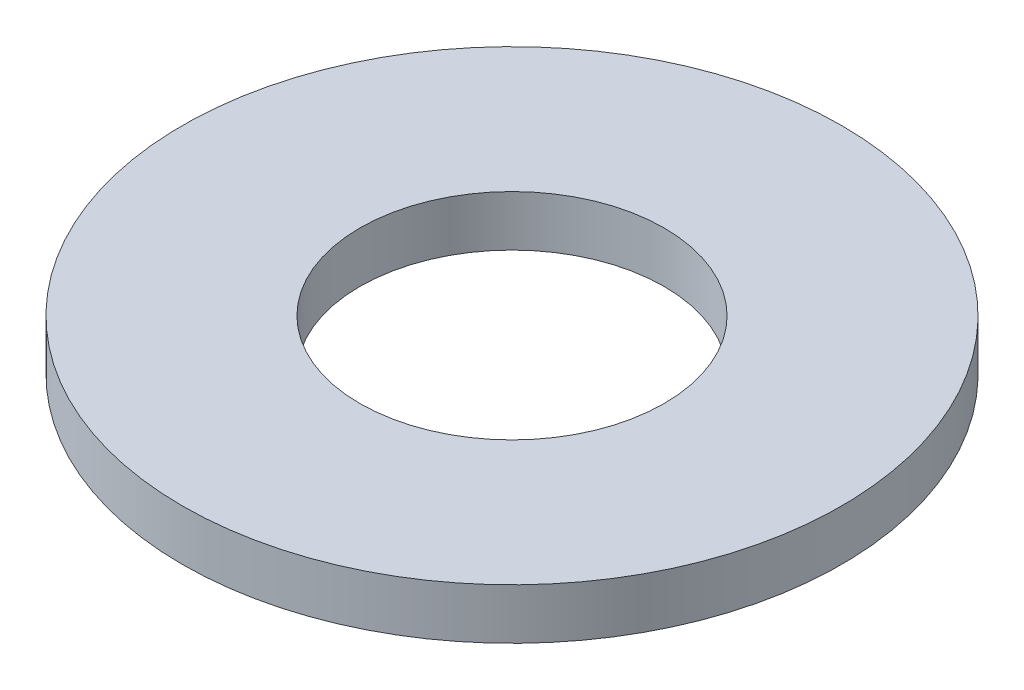
ISO-10303-21;
HEADER;
FILE_DESCRIPTION(('STEP AP214'),'2;1');
FILE_NAME('part.step','',(''),(''),'','','');
FILE_SCHEMA(('AUTOMOTIVE_DESIGN { 1 0 10303 214 1 1 1 1 }'));
ENDSEC;
DATA;
#1=APPLICATION_CONTEXT('core data for automotive mechanical design processes');
#2=APPLICATION_PROTOCOL_DEFINITION('international standard','automotive_design',2000,#1);
#3=PRODUCT_CONTEXT('',#1,'mechanical');
#4=PRODUCT('Part','Part','',(#3));
#5=PRODUCT_RELATED_PRODUCT_CATEGORY('part','',(#4));
#6=PRODUCT_DEFINITION_FORMATION('','',#4);
#7=PRODUCT_DEFINITION_CONTEXT('part definition',#1,'design');
#8=PRODUCT_DEFINITION('design','',#6,#7);
#9=PRODUCT_DEFINITION_SHAPE('','',#8);
#10=(LENGTH_UNIT() NAMED_UNIT(*) SI_UNIT(.MILLI.,.METRE.));
#11=(NAMED_UNIT(*) PLANE_ANGLE_UNIT() SI_UNIT($,.RADIAN.));
#12=(NAMED_UNIT(*) SI_UNIT($,.STERADIAN.) SOLID_ANGLE_UNIT());
#13=UNCERTAINTY_MEASURE_WITH_UNIT(LENGTH_MEASURE(1.E-05),#10,'distance_accuracy_value','');
#14=(GEOMETRIC_REPRESENTATION_CONTEXT(3) GLOBAL_UNCERTAINTY_ASSIGNED_CONTEXT((#13)) GLOBAL_UNIT_ASSIGNED_CONTEXT((#10,
#11,#12)) REPRESENTATION_CONTEXT('',''));
#15=CARTESIAN_POINT('',(0.,0.,0.));
#16=DIRECTION('',(0.,0.,1.));
#17=DIRECTION('',(1.,0.,0.));
#18=AXIS2_PLACEMENT_3D('',#15,#16,#17);
#19=CARTESIAN_POINT('',(0.,1.,0.));
#20=DIRECTION('',(0.,1.,0.));
#21=DIRECTION('',(0.,0.,1.));
#22=AXIS2_PLACEMENT_3D('',#19,#20,#21);
#23=PLANE('',#22);
#24=CARTESIAN_POINT('',(0.,1.,0.));
#25=DIRECTION('',(0.,1.,0.));
#26=DIRECTION('',(0.,0.,1.));
#27=AXIS2_PLACEMENT_3D('',#24,#25,#26);
#28=CIRCLE('',#27,6.5);
#29=CARTESIAN_POINT('',(0.,1.,6.5));
#30=VERTEX_POINT('',#29);
#31=EDGE_CURVE('E10',#30,#30,#28,.T.);
#32=ORIENTED_EDGE('',*,*,#31,.T.);
#33=EDGE_LOOP('',(#32));
#34=FACE_BOUND('',#33,.T.);
#35=CARTESIAN_POINT('',(0.,1.,0.));
#36=DIRECTION('',(0.,1.,0.));
#37=DIRECTION('',(0.,0.,1.));
#38=AXIS2_PLACEMENT_3D('',#35,#36,#37);
#39=CIRCLE('',#38,3.);
#40=CARTESIAN_POINT('',(0.,1.,3.));
#41=VERTEX_POINT('',#40);
#42=EDGE_CURVE('E45',#41,#41,#39,.T.);
#43=ORIENTED_EDGE('',*,*,#42,.F.);
#44=EDGE_LOOP('',(#43));
#45=FACE_BOUND('',#44,.T.);
#46=ADVANCED_FACE('F34',(#34,#45),#23,.T.);
#47=CARTESIAN_POINT('',(0.,0.,0.));
#48=DIRECTION('',(0.,1.,0.));
#49=DIRECTION('',(0.,0.,1.));
#50=AXIS2_PLACEMENT_3D('',#47,#48,#49);
#51=PLANE('',#50);
#52=CARTESIAN_POINT('',(0.,0.,0.));
#53=DIRECTION('',(0.,1.,0.));
#54=DIRECTION('',(0.,0.,1.));
#55=AXIS2_PLACEMENT_3D('',#52,#53,#54);
#56=CIRCLE('',#55,6.5);
#57=CARTESIAN_POINT('',(0.,0.,6.5));
#58=VERTEX_POINT('',#57);
#59=EDGE_CURVE('E38',#58,#58,#56,.T.);
#60=ORIENTED_EDGE('',*,*,#59,.F.);
#61=EDGE_LOOP('',(#60));
#62=FACE_BOUND('',#61,.T.);
#63=CARTESIAN_POINT('',(0.,0.,0.));
#64=DIRECTION('',(0.,1.,0.));
#65=DIRECTION('',(0.,0.,1.));
#66=AXIS2_PLACEMENT_3D('',#63,#64,#65);
#67=CIRCLE('',#66,3.);
#68=CARTESIAN_POINT('',(0.,0.,3.));
#69=VERTEX_POINT('',#68);
#70=EDGE_CURVE('E47',#69,#69,#67,.T.);
#71=ORIENTED_EDGE('',*,*,#70,.T.);
#72=EDGE_LOOP('',(#71));
#73=FACE_BOUND('',#72,.T.);
#74=ADVANCED_FACE('F57',(#62,#73),#51,.F.);
#75=CARTESIAN_POINT('',(0.,1.,0.));
#76=DIRECTION('',(0.,-1.,0.));
#77=DIRECTION('',(0.,0.,-1.));
#78=AXIS2_PLACEMENT_3D('',#75,#76,#77);
#79=CYLINDRICAL_SURFACE('',#78,6.5);
#80=ORIENTED_EDGE('',*,*,#31,.F.);
#81=EDGE_LOOP('',(#80));
#82=FACE_BOUND('',#81,.T.);
#83=ORIENTED_EDGE('',*,*,#59,.T.);
#84=EDGE_LOOP('',(#83));
#85=FACE_BOUND('',#84,.T.);
#86=ADVANCED_FACE('F36',(#82,#85),#79,.T.);
#87=CARTESIAN_POINT('',(0.,1.,0.));
#88=DIRECTION('',(0.,-1.,0.));
#89=DIRECTION('',(0.,0.,-1.));
#90=AXIS2_PLACEMENT_3D('',#87,#88,#89);
#91=CYLINDRICAL_SURFACE('',#90,3.);
#92=ORIENTED_EDGE('',*,*,#42,.T.);
#93=EDGE_LOOP('',(#92));
#94=FACE_BOUND('',#93,.T.);
#95=ORIENTED_EDGE('',*,*,#70,.F.);
#96=EDGE_LOOP('',(#95));
#97=FACE_BOUND('',#96,.T.);
#98=ADVANCED_FACE('F53',(#94,#97),#91,.F.);
#99=CLOSED_SHELL('',(#46,#74,#86,#98));
#100=MANIFOLD_SOLID_BREP('B2',#99);
#101=ADVANCED_BREP_SHAPE_REPRESENTATION('',(#18,#100),#14);
#102=SHAPE_DEFINITION_REPRESENTATION(#9,#101);
ENDSEC;
END-ISO-10303-21;
